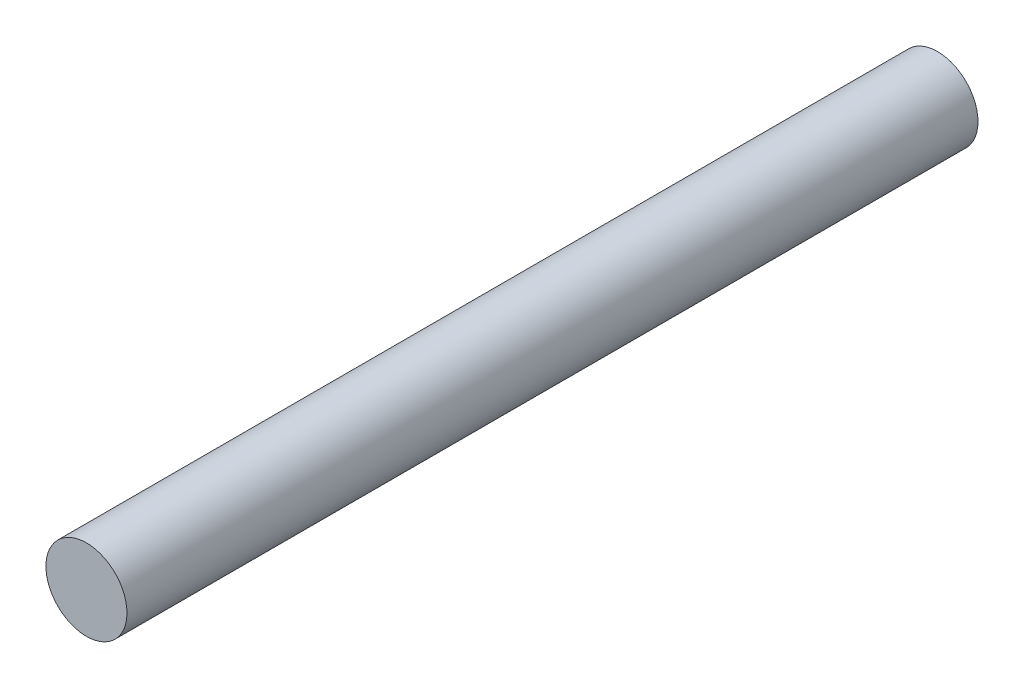
ISO-10303-21;
HEADER;
FILE_DESCRIPTION(('STEP AP214'),'2;1');
FILE_NAME('part.step','',(''),(''),'','','');
FILE_SCHEMA(('AUTOMOTIVE_DESIGN { 1 0 10303 214 1 1 1 1 }'));
ENDSEC;
DATA;
#1=APPLICATION_CONTEXT('core data for automotive mechanical design processes');
#2=APPLICATION_PROTOCOL_DEFINITION('international standard','automotive_design',2000,#1);
#3=PRODUCT_CONTEXT('',#1,'mechanical');
#4=PRODUCT('Part','Part','',(#3));
#5=PRODUCT_RELATED_PRODUCT_CATEGORY('part','',(#4));
#6=PRODUCT_DEFINITION_FORMATION('','',#4);
#7=PRODUCT_DEFINITION_CONTEXT('part definition',#1,'design');
#8=PRODUCT_DEFINITION('design','',#6,#7);
#9=PRODUCT_DEFINITION_SHAPE('','',#8);
#10=(LENGTH_UNIT() NAMED_UNIT(*) SI_UNIT(.MILLI.,.METRE.));
#11=(NAMED_UNIT(*) PLANE_ANGLE_UNIT() SI_UNIT($,.RADIAN.));
#12=(NAMED_UNIT(*) SI_UNIT($,.STERADIAN.) SOLID_ANGLE_UNIT());
#13=UNCERTAINTY_MEASURE_WITH_UNIT(LENGTH_MEASURE(1.E-05),#10,'distance_accuracy_value','');
#14=(GEOMETRIC_REPRESENTATION_CONTEXT(3) GLOBAL_UNCERTAINTY_ASSIGNED_CONTEXT((#13)) GLOBAL_UNIT_ASSIGNED_CONTEXT((#10,
#11,#12)) REPRESENTATION_CONTEXT('',''));
#15=CARTESIAN_POINT('',(0.,0.,0.));
#16=DIRECTION('',(0.,0.,1.));
#17=DIRECTION('',(1.,0.,0.));
#18=AXIS2_PLACEMENT_3D('',#15,#16,#17);
#19=CARTESIAN_POINT('',(0.,0.,63.));
#20=DIRECTION('',(0.,0.,-1.));
#21=DIRECTION('',(-1.,0.,0.));
#22=AXIS2_PLACEMENT_3D('',#19,#20,#21);
#23=CYLINDRICAL_SURFACE('',#22,3.);
#24=CARTESIAN_POINT('',(0.,0.,63.));
#25=DIRECTION('',(0.,0.,1.));
#26=DIRECTION('',(1.,0.,0.));
#27=AXIS2_PLACEMENT_3D('',#24,#25,#26);
#28=CIRCLE('',#27,3.);
#29=CARTESIAN_POINT('',(3.,0.,63.));
#30=VERTEX_POINT('',#29);
#31=EDGE_CURVE('E10',#30,#30,#28,.T.);
#32=ORIENTED_EDGE('',*,*,#31,.F.);
#33=EDGE_LOOP('',(#32));
#34=FACE_BOUND('',#33,.T.);
#35=CARTESIAN_POINT('',(0.,0.,0.));
#36=DIRECTION('',(0.,0.,1.));
#37=DIRECTION('',(1.,0.,0.));
#38=AXIS2_PLACEMENT_3D('',#35,#36,#37);
#39=CIRCLE('',#38,3.);
#40=CARTESIAN_POINT('',(3.,0.,0.));
#41=VERTEX_POINT('',#40);
#42=EDGE_CURVE('E40',#41,#41,#39,.T.);
#43=ORIENTED_EDGE('',*,*,#42,.T.);
#44=EDGE_LOOP('',(#43));
#45=FACE_BOUND('',#44,.T.);
#46=ADVANCED_FACE('F37',(#34,#45),#23,.T.);
#47=CARTESIAN_POINT('',(0.,0.,63.));
#48=DIRECTION('',(0.,0.,1.));
#49=DIRECTION('',(1.,0.,0.));
#50=AXIS2_PLACEMENT_3D('',#47,#48,#49);
#51=PLANE('',#50);
#52=ORIENTED_EDGE('',*,*,#31,.T.);
#53=EDGE_LOOP('',(#52));
#54=FACE_BOUND('',#53,.T.);
#55=ADVANCED_FACE('F54',(#54),#51,.T.);
#56=CARTESIAN_POINT('',(0.,0.,0.));
#57=DIRECTION('',(0.,0.,1.));
#58=DIRECTION('',(1.,0.,0.));
#59=AXIS2_PLACEMENT_3D('',#56,#57,#58);
#60=PLANE('',#59);
#61=ORIENTED_EDGE('',*,*,#42,.F.);
#62=EDGE_LOOP('',(#61));
#63=FACE_BOUND('',#62,.T.);
#64=ADVANCED_FACE('F52',(#63),#60,.F.);
#65=CLOSED_SHELL('',(#46,#55,#64));
#66=MANIFOLD_SOLID_BREP('B2',#65);
#67=ADVANCED_BREP_SHAPE_REPRESENTATION('',(#18,#66),#14);
#68=SHAPE_DEFINITION_REPRESENTATION(#9,#67);
ENDSEC;
END-ISO-10303-21;
